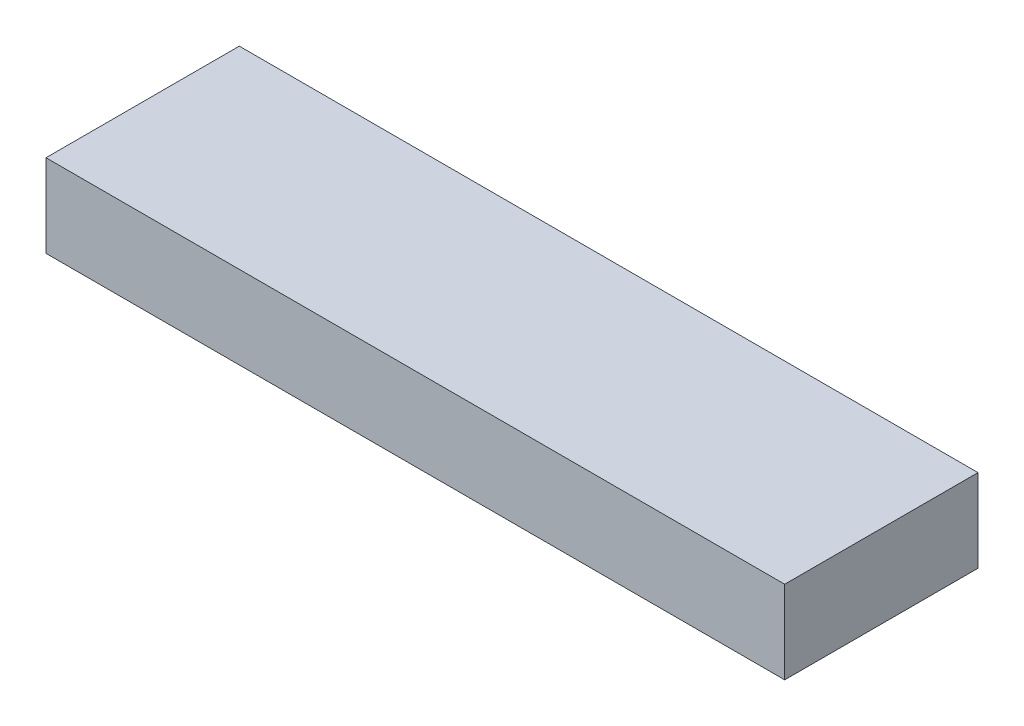
ISO-10303-21;
HEADER;
FILE_DESCRIPTION(('STEP AP214'),'2;1');
FILE_NAME('part.step','',(''),(''),'','','');
FILE_SCHEMA(('AUTOMOTIVE_DESIGN { 1 0 10303 214 1 1 1 1 }'));
ENDSEC;
DATA;
#1=APPLICATION_CONTEXT('core data for automotive mechanical design processes');
#2=APPLICATION_PROTOCOL_DEFINITION('international standard','automotive_design',2000,#1);
#3=PRODUCT_CONTEXT('',#1,'mechanical');
#4=PRODUCT('Part','Part','',(#3));
#5=PRODUCT_RELATED_PRODUCT_CATEGORY('part','',(#4));
#6=PRODUCT_DEFINITION_FORMATION('','',#4);
#7=PRODUCT_DEFINITION_CONTEXT('part definition',#1,'design');
#8=PRODUCT_DEFINITION('design','',#6,#7);
#9=PRODUCT_DEFINITION_SHAPE('','',#8);
#10=(LENGTH_UNIT() NAMED_UNIT(*) SI_UNIT(.MILLI.,.METRE.));
#11=(NAMED_UNIT(*) PLANE_ANGLE_UNIT() SI_UNIT($,.RADIAN.));
#12=(NAMED_UNIT(*) SI_UNIT($,.STERADIAN.) SOLID_ANGLE_UNIT());
#13=UNCERTAINTY_MEASURE_WITH_UNIT(LENGTH_MEASURE(1.E-05),#10,'distance_accuracy_value','');
#14=(GEOMETRIC_REPRESENTATION_CONTEXT(3) GLOBAL_UNCERTAINTY_ASSIGNED_CONTEXT((#13)) GLOBAL_UNIT_ASSIGNED_CONTEXT((#10,
#11,#12)) REPRESENTATION_CONTEXT('',''));
#15=CARTESIAN_POINT('',(0.,0.,0.));
#16=DIRECTION('',(0.,0.,1.));
#17=DIRECTION('',(1.,0.,0.));
#18=AXIS2_PLACEMENT_3D('',#15,#16,#17);
#19=CARTESIAN_POINT('',(0.,38.1,0.));
#20=DIRECTION('',(1.,0.,0.));
#21=DIRECTION('',(0.,0.,-1.));
#22=AXIS2_PLACEMENT_3D('',#19,#20,#21);
#23=PLANE('',#22);
#24=DIRECTION('',(0.,0.,1.));
#25=VECTOR('',#24,1.);
#26=CARTESIAN_POINT('',(0.,0.,0.));
#27=LINE('',#26,#25);
#28=CARTESIAN_POINT('',(0.,0.,-88.9));
#29=VERTEX_POINT('',#28);
#30=CARTESIAN_POINT('',(0.,0.,0.));
#31=VERTEX_POINT('',#30);
#32=EDGE_CURVE('E101',#29,#31,#27,.T.);
#33=ORIENTED_EDGE('',*,*,#32,.T.);
#34=DIRECTION('',(0.,-1.,0.));
#35=VECTOR('',#34,1.);
#36=CARTESIAN_POINT('',(0.,38.1,0.));
#37=LINE('',#36,#35);
#38=CARTESIAN_POINT('',(0.,38.1,0.));
#39=VERTEX_POINT('',#38);
#40=EDGE_CURVE('E11',#39,#31,#37,.T.);
#41=ORIENTED_EDGE('',*,*,#40,.F.);
#42=DIRECTION('',(0.,0.,1.));
#43=VECTOR('',#42,1.);
#44=CARTESIAN_POINT('',(0.,38.1,0.));
#45=LINE('',#44,#43);
#46=CARTESIAN_POINT('',(0.,38.1,-88.9));
#47=VERTEX_POINT('',#46);
#48=EDGE_CURVE('E89',#47,#39,#45,.T.);
#49=ORIENTED_EDGE('',*,*,#48,.F.);
#50=DIRECTION('',(0.,-1.,0.));
#51=VECTOR('',#50,1.);
#52=CARTESIAN_POINT('',(0.,38.1,-88.9));
#53=LINE('',#52,#51);
#54=EDGE_CURVE('E97',#47,#29,#53,.T.);
#55=ORIENTED_EDGE('',*,*,#54,.T.);
#56=EDGE_LOOP('',(#33,#41,#49,#55));
#57=FACE_BOUND('',#56,.T.);
#58=ADVANCED_FACE('F38',(#57),#23,.F.);
#59=CARTESIAN_POINT('',(0.,38.1,0.));
#60=DIRECTION('',(0.,0.,-1.));
#61=DIRECTION('',(-1.,0.,0.));
#62=AXIS2_PLACEMENT_3D('',#59,#60,#61);
#63=PLANE('',#62);
#64=DIRECTION('',(1.,0.,0.));
#65=VECTOR('',#64,1.);
#66=CARTESIAN_POINT('',(0.,0.,0.));
#67=LINE('',#66,#65);
#68=CARTESIAN_POINT('',(339.725,0.,0.));
#69=VERTEX_POINT('',#68);
#70=EDGE_CURVE('E93',#31,#69,#67,.T.);
#71=ORIENTED_EDGE('',*,*,#70,.T.);
#72=DIRECTION('',(0.,-1.,0.));
#73=VECTOR('',#72,1.);
#74=CARTESIAN_POINT('',(339.725,38.1,0.));
#75=LINE('',#74,#73);
#76=CARTESIAN_POINT('',(339.725,38.1,0.));
#77=VERTEX_POINT('',#76);
#78=EDGE_CURVE('E46',#77,#69,#75,.T.);
#79=ORIENTED_EDGE('',*,*,#78,.F.);
#80=DIRECTION('',(1.,0.,0.));
#81=VECTOR('',#80,1.);
#82=CARTESIAN_POINT('',(0.,38.1,0.));
#83=LINE('',#82,#81);
#84=EDGE_CURVE('E84',#39,#77,#83,.T.);
#85=ORIENTED_EDGE('',*,*,#84,.F.);
#86=ORIENTED_EDGE('',*,*,#40,.T.);
#87=EDGE_LOOP('',(#71,#79,#85,#86));
#88=FACE_BOUND('',#87,.T.);
#89=ADVANCED_FACE('F92',(#88),#63,.F.);
#90=CARTESIAN_POINT('',(339.725,38.1,0.));
#91=DIRECTION('',(-1.,0.,0.));
#92=DIRECTION('',(0.,0.,1.));
#93=AXIS2_PLACEMENT_3D('',#90,#91,#92);
#94=PLANE('',#93);
#95=DIRECTION('',(0.,0.,-1.));
#96=VECTOR('',#95,1.);
#97=CARTESIAN_POINT('',(339.725,0.,0.));
#98=LINE('',#97,#96);
#99=CARTESIAN_POINT('',(339.725,0.,-88.9));
#100=VERTEX_POINT('',#99);
#101=EDGE_CURVE('E71',#69,#100,#98,.T.);
#102=ORIENTED_EDGE('',*,*,#101,.T.);
#103=DIRECTION('',(0.,-1.,0.));
#104=VECTOR('',#103,1.);
#105=CARTESIAN_POINT('',(339.725,38.1,-88.9));
#106=LINE('',#105,#104);
#107=CARTESIAN_POINT('',(339.725,38.1,-88.9));
#108=VERTEX_POINT('',#107);
#109=EDGE_CURVE('E94',#108,#100,#106,.T.);
#110=ORIENTED_EDGE('',*,*,#109,.F.);
#111=DIRECTION('',(0.,0.,-1.));
#112=VECTOR('',#111,1.);
#113=CARTESIAN_POINT('',(339.725,38.1,0.));
#114=LINE('',#113,#112);
#115=EDGE_CURVE('E87',#77,#108,#114,.T.);
#116=ORIENTED_EDGE('',*,*,#115,.F.);
#117=ORIENTED_EDGE('',*,*,#78,.T.);
#118=EDGE_LOOP('',(#102,#110,#116,#117));
#119=FACE_BOUND('',#118,.T.);
#120=ADVANCED_FACE('F95',(#119),#94,.F.);
#121=CARTESIAN_POINT('',(0.,38.1,-88.9));
#122=DIRECTION('',(0.,0.,1.));
#123=DIRECTION('',(1.,0.,0.));
#124=AXIS2_PLACEMENT_3D('',#121,#122,#123);
#125=PLANE('',#124);
#126=DIRECTION('',(-1.,0.,0.));
#127=VECTOR('',#126,1.);
#128=CARTESIAN_POINT('',(0.,0.,-88.9));
#129=LINE('',#128,#127);
#130=EDGE_CURVE('E77',#100,#29,#129,.T.);
#131=ORIENTED_EDGE('',*,*,#130,.T.);
#132=ORIENTED_EDGE('',*,*,#54,.F.);
#133=DIRECTION('',(-1.,0.,0.));
#134=VECTOR('',#133,1.);
#135=CARTESIAN_POINT('',(0.,38.1,-88.9));
#136=LINE('',#135,#134);
#137=EDGE_CURVE('E54',#108,#47,#136,.T.);
#138=ORIENTED_EDGE('',*,*,#137,.F.);
#139=ORIENTED_EDGE('',*,*,#109,.T.);
#140=EDGE_LOOP('',(#131,#132,#138,#139));
#141=FACE_BOUND('',#140,.T.);
#142=ADVANCED_FACE('F108',(#141),#125,.F.);
#143=CARTESIAN_POINT('',(0.,38.1,0.));
#144=DIRECTION('',(0.,-1.,0.));
#145=DIRECTION('',(0.,0.,-1.));
#146=AXIS2_PLACEMENT_3D('',#143,#144,#145);
#147=PLANE('',#146);
#148=ORIENTED_EDGE('',*,*,#48,.T.);
#149=ORIENTED_EDGE('',*,*,#84,.T.);
#150=ORIENTED_EDGE('',*,*,#115,.T.);
#151=ORIENTED_EDGE('',*,*,#137,.T.);
#152=EDGE_LOOP('',(#148,#149,#150,#151));
#153=FACE_BOUND('',#152,.T.);
#154=ADVANCED_FACE('F85',(#153),#147,.F.);
#155=CARTESIAN_POINT('',(0.,0.,0.));
#156=DIRECTION('',(0.,-1.,0.));
#157=DIRECTION('',(0.,0.,-1.));
#158=AXIS2_PLACEMENT_3D('',#155,#156,#157);
#159=PLANE('',#158);
#160=ORIENTED_EDGE('',*,*,#32,.F.);
#161=ORIENTED_EDGE('',*,*,#130,.F.);
#162=ORIENTED_EDGE('',*,*,#101,.F.);
#163=ORIENTED_EDGE('',*,*,#70,.F.);
#164=EDGE_LOOP('',(#160,#161,#162,#163));
#165=FACE_BOUND('',#164,.T.);
#166=ADVANCED_FACE('F111',(#165),#159,.T.);
#167=CLOSED_SHELL('',(#58,#89,#120,#142,#154,#166));
#168=MANIFOLD_SOLID_BREP('B2',#167);
#169=ADVANCED_BREP_SHAPE_REPRESENTATION('',(#18,#168),#14);
#170=SHAPE_DEFINITION_REPRESENTATION(#9,#169);
ENDSEC;
END-ISO-10303-21;
